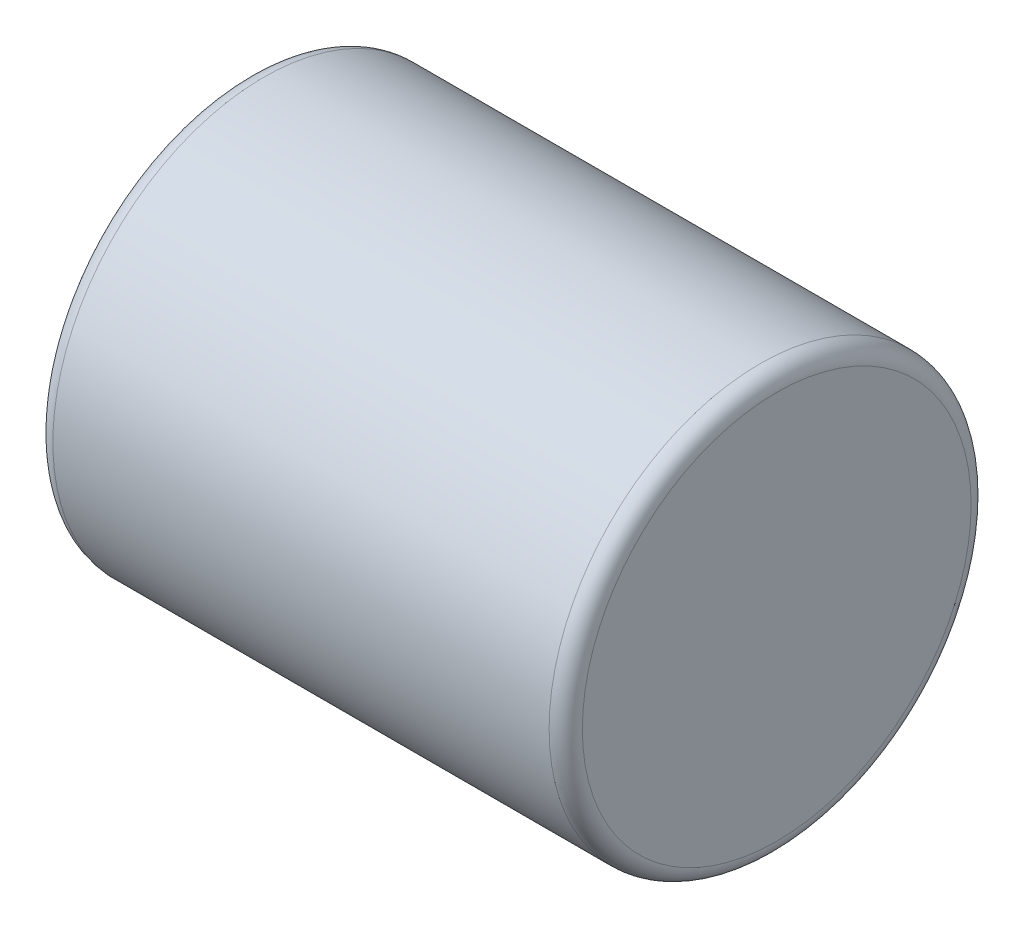
ISO-10303-21;
HEADER;
FILE_DESCRIPTION(('STEP AP214'),'2;1');
FILE_NAME('part.step','',(''),(''),'','','');
FILE_SCHEMA(('AUTOMOTIVE_DESIGN { 1 0 10303 214 1 1 1 1 }'));
ENDSEC;
DATA;
#1=APPLICATION_CONTEXT('core data for automotive mechanical design processes');
#2=APPLICATION_PROTOCOL_DEFINITION('international standard','automotive_design',2000,#1);
#3=PRODUCT_CONTEXT('',#1,'mechanical');
#4=PRODUCT('Part','Part','',(#3));
#5=PRODUCT_RELATED_PRODUCT_CATEGORY('part','',(#4));
#6=PRODUCT_DEFINITION_FORMATION('','',#4);
#7=PRODUCT_DEFINITION_CONTEXT('part definition',#1,'design');
#8=PRODUCT_DEFINITION('design','',#6,#7);
#9=PRODUCT_DEFINITION_SHAPE('','',#8);
#10=(LENGTH_UNIT() NAMED_UNIT(*) SI_UNIT(.MILLI.,.METRE.));
#11=(NAMED_UNIT(*) PLANE_ANGLE_UNIT() SI_UNIT($,.RADIAN.));
#12=(NAMED_UNIT(*) SI_UNIT($,.STERADIAN.) SOLID_ANGLE_UNIT());
#13=UNCERTAINTY_MEASURE_WITH_UNIT(LENGTH_MEASURE(1.E-05),#10,'distance_accuracy_value','');
#14=(GEOMETRIC_REPRESENTATION_CONTEXT(3) GLOBAL_UNCERTAINTY_ASSIGNED_CONTEXT((#13)) GLOBAL_UNIT_ASSIGNED_CONTEXT((#10,
#11,#12)) REPRESENTATION_CONTEXT('',''));
#15=CARTESIAN_POINT('',(0.,0.,0.));
#16=DIRECTION('',(0.,0.,1.));
#17=DIRECTION('',(1.,0.,0.));
#18=AXIS2_PLACEMENT_3D('',#15,#16,#17);
#19=CARTESIAN_POINT('',(15.9333333333333,6.35,6.825));
#20=DIRECTION('',(-1.,0.,0.));
#21=DIRECTION('',(0.,0.,1.));
#22=AXIS2_PLACEMENT_3D('',#19,#20,#21);
#23=PLANE('',#22);
#24=CARTESIAN_POINT('',(15.9333333333333,6.35,6.825));
#25=DIRECTION('',(-1.,0.,0.));
#26=DIRECTION('',(0.,0.,1.));
#27=AXIS2_PLACEMENT_3D('',#24,#25,#26);
#28=CIRCLE('',#27,11.7);
#29=CARTESIAN_POINT('',(15.9333333333333,6.35,18.525));
#30=VERTEX_POINT('',#29);
#31=EDGE_CURVE('E10',#30,#30,#28,.F.);
#32=ORIENTED_EDGE('',*,*,#31,.T.);
#33=EDGE_LOOP('',(#32));
#34=FACE_BOUND('',#33,.T.);
#35=ADVANCED_FACE('F30',(#34),#23,.F.);
#36=CARTESIAN_POINT('',(-51.85435781761,6.35,6.825));
#37=DIRECTION('',(1.,0.,0.));
#38=DIRECTION('',(0.,0.,-1.));
#39=AXIS2_PLACEMENT_3D('',#36,#37,#38);
#40=CYLINDRICAL_SURFACE('',#39,12.7);
#41=CARTESIAN_POINT('',(-14.9333333333333,6.35,6.825));
#42=DIRECTION('',(1.,0.,0.));
#43=DIRECTION('',(0.,0.,-1.));
#44=AXIS2_PLACEMENT_3D('',#41,#42,#43);
#45=CIRCLE('',#44,12.7);
#46=CARTESIAN_POINT('',(-14.9333333333333,6.35,-5.875));
#47=VERTEX_POINT('',#46);
#48=EDGE_CURVE('E41',#47,#47,#45,.T.);
#49=ORIENTED_EDGE('',*,*,#48,.T.);
#50=EDGE_LOOP('',(#49));
#51=FACE_BOUND('',#50,.T.);
#52=CARTESIAN_POINT('',(14.9333333333333,6.35,6.825));
#53=DIRECTION('',(-1.,0.,0.));
#54=DIRECTION('',(0.,0.,1.));
#55=AXIS2_PLACEMENT_3D('',#52,#53,#54);
#56=CIRCLE('',#55,12.7);
#57=CARTESIAN_POINT('',(14.9333333333333,6.35,19.525));
#58=VERTEX_POINT('',#57);
#59=EDGE_CURVE('E45',#58,#58,#56,.T.);
#60=ORIENTED_EDGE('',*,*,#59,.T.);
#61=EDGE_LOOP('',(#60));
#62=FACE_BOUND('',#61,.T.);
#63=ADVANCED_FACE('F51',(#51,#62),#40,.T.);
#64=CARTESIAN_POINT('',(-15.9333333333333,0.,0.));
#65=DIRECTION('',(1.,0.,0.));
#66=DIRECTION('',(0.,0.,-1.));
#67=AXIS2_PLACEMENT_3D('',#64,#65,#66);
#68=PLANE('',#67);
#69=CARTESIAN_POINT('',(-15.9333333333333,6.35,6.825));
#70=DIRECTION('',(1.,0.,0.));
#71=DIRECTION('',(0.,0.,-1.));
#72=AXIS2_PLACEMENT_3D('',#69,#70,#71);
#73=CIRCLE('',#72,11.7);
#74=CARTESIAN_POINT('',(-15.9333333333333,6.35,-4.875));
#75=VERTEX_POINT('',#74);
#76=EDGE_CURVE('E37',#75,#75,#73,.F.);
#77=ORIENTED_EDGE('',*,*,#76,.T.);
#78=EDGE_LOOP('',(#77));
#79=FACE_BOUND('',#78,.T.);
#80=ADVANCED_FACE('F59',(#79),#68,.F.);
#81=CARTESIAN_POINT('',(-14.9333333333333,6.35,6.825));
#82=DIRECTION('',(1.,0.,0.));
#83=DIRECTION('',(0.,0.,-1.));
#84=AXIS2_PLACEMENT_3D('',#81,#82,#83);
#85=TOROIDAL_SURFACE('',#84,11.7,1.);
#86=ORIENTED_EDGE('',*,*,#76,.F.);
#87=EDGE_LOOP('',(#86));
#88=FACE_BOUND('',#87,.T.);
#89=ORIENTED_EDGE('',*,*,#48,.F.);
#90=EDGE_LOOP('',(#89));
#91=FACE_BOUND('',#90,.T.);
#92=ADVANCED_FACE('F54',(#88,#91),#85,.T.);
#93=CARTESIAN_POINT('',(14.9333333333333,6.35,6.825));
#94=DIRECTION('',(-1.,0.,0.));
#95=DIRECTION('',(0.,0.,1.));
#96=AXIS2_PLACEMENT_3D('',#93,#94,#95);
#97=TOROIDAL_SURFACE('',#96,11.7,1.);
#98=ORIENTED_EDGE('',*,*,#31,.F.);
#99=EDGE_LOOP('',(#98));
#100=FACE_BOUND('',#99,.T.);
#101=ORIENTED_EDGE('',*,*,#59,.F.);
#102=EDGE_LOOP('',(#101));
#103=FACE_BOUND('',#102,.T.);
#104=ADVANCED_FACE('F32',(#100,#103),#97,.T.);
#105=CLOSED_SHELL('',(#35,#63,#80,#92,#104));
#106=MANIFOLD_SOLID_BREP('B2',#105);
#107=ADVANCED_BREP_SHAPE_REPRESENTATION('',(#18,#106),#14);
#108=SHAPE_DEFINITION_REPRESENTATION(#9,#107);
ENDSEC;
END-ISO-10303-21;
